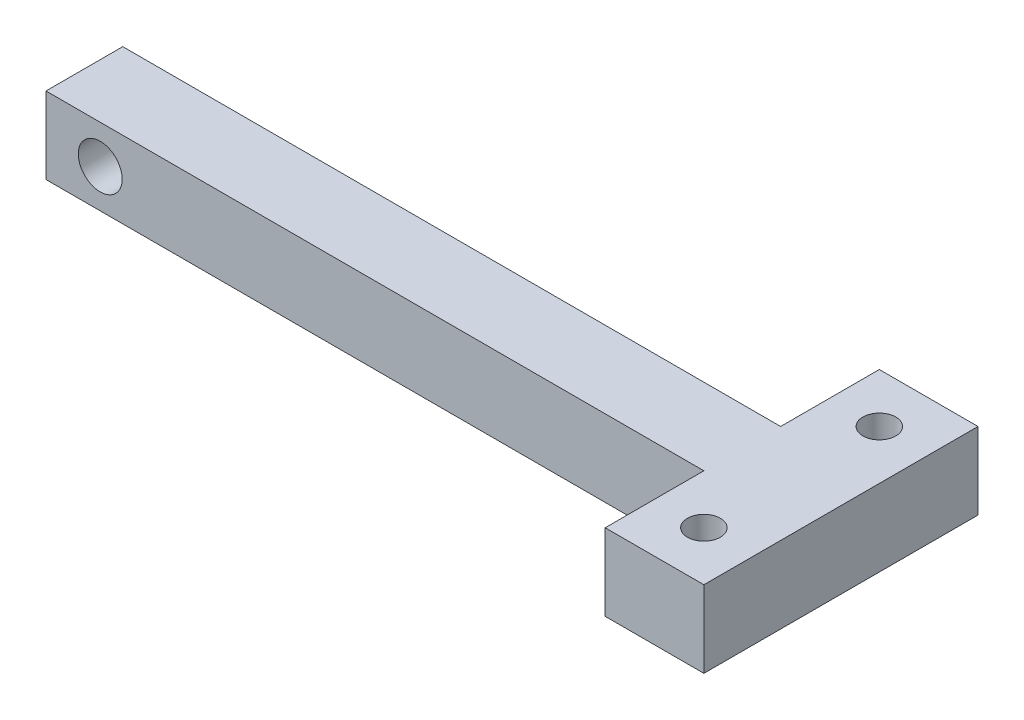
ISO-10303-21;
HEADER;
FILE_DESCRIPTION(('STEP AP214'),'2;1');
FILE_NAME('part.step','',(''),(''),'','','');
FILE_SCHEMA(('AUTOMOTIVE_DESIGN { 1 0 10303 214 1 1 1 1 }'));
ENDSEC;
DATA;
#1=APPLICATION_CONTEXT('core data for automotive mechanical design processes');
#2=APPLICATION_PROTOCOL_DEFINITION('international standard','automotive_design',2000,#1);
#3=PRODUCT_CONTEXT('',#1,'mechanical');
#4=PRODUCT('Part','Part','',(#3));
#5=PRODUCT_RELATED_PRODUCT_CATEGORY('part','',(#4));
#6=PRODUCT_DEFINITION_FORMATION('','',#4);
#7=PRODUCT_DEFINITION_CONTEXT('part definition',#1,'design');
#8=PRODUCT_DEFINITION('design','',#6,#7);
#9=PRODUCT_DEFINITION_SHAPE('','',#8);
#10=(LENGTH_UNIT() NAMED_UNIT(*) SI_UNIT(.MILLI.,.METRE.));
#11=(NAMED_UNIT(*) PLANE_ANGLE_UNIT() SI_UNIT($,.RADIAN.));
#12=(NAMED_UNIT(*) SI_UNIT($,.STERADIAN.) SOLID_ANGLE_UNIT());
#13=UNCERTAINTY_MEASURE_WITH_UNIT(LENGTH_MEASURE(1.E-05),#10,'distance_accuracy_value','');
#14=(GEOMETRIC_REPRESENTATION_CONTEXT(3) GLOBAL_UNCERTAINTY_ASSIGNED_CONTEXT((#13)) GLOBAL_UNIT_ASSIGNED_CONTEXT((#10,
#11,#12)) REPRESENTATION_CONTEXT('',''));
#15=CARTESIAN_POINT('',(0.,0.,0.));
#16=DIRECTION('',(0.,0.,1.));
#17=DIRECTION('',(1.,0.,0.));
#18=AXIS2_PLACEMENT_3D('',#15,#16,#17);
#19=CARTESIAN_POINT('',(69.,7.,0.));
#20=DIRECTION('',(1.,0.,0.));
#21=DIRECTION('',(0.,0.,-1.));
#22=AXIS2_PLACEMENT_3D('',#19,#20,#21);
#23=PLANE('',#22);
#24=DIRECTION('',(0.,0.,1.));
#25=VECTOR('',#24,1.);
#26=CARTESIAN_POINT('',(69.,0.,0.));
#27=LINE('',#26,#25);
#28=CARTESIAN_POINT('',(69.,0.,-16.));
#29=VERTEX_POINT('',#28);
#30=CARTESIAN_POINT('',(69.,0.,9.));
#31=VERTEX_POINT('',#30);
#32=EDGE_CURVE('E180',#29,#31,#27,.T.);
#33=ORIENTED_EDGE('',*,*,#32,.F.);
#34=DIRECTION('',(0.,-1.,0.));
#35=VECTOR('',#34,1.);
#36=CARTESIAN_POINT('',(69.,7.,-16.));
#37=LINE('',#36,#35);
#38=CARTESIAN_POINT('',(69.,7.,-16.));
#39=VERTEX_POINT('',#38);
#40=EDGE_CURVE('E11',#39,#29,#37,.T.);
#41=ORIENTED_EDGE('',*,*,#40,.F.);
#42=DIRECTION('',(0.,0.,1.));
#43=VECTOR('',#42,1.);
#44=CARTESIAN_POINT('',(69.,7.,0.));
#45=LINE('',#44,#43);
#46=CARTESIAN_POINT('',(69.,7.,9.));
#47=VERTEX_POINT('',#46);
#48=EDGE_CURVE('E270',#39,#47,#45,.T.);
#49=ORIENTED_EDGE('',*,*,#48,.T.);
#50=DIRECTION('',(0.,-1.,0.));
#51=VECTOR('',#50,1.);
#52=CARTESIAN_POINT('',(69.,7.,9.));
#53=LINE('',#52,#51);
#54=EDGE_CURVE('E99',#47,#31,#53,.T.);
#55=ORIENTED_EDGE('',*,*,#54,.T.);
#56=EDGE_LOOP('',(#33,#41,#49,#55));
#57=FACE_BOUND('',#56,.T.);
#58=ADVANCED_FACE('F47',(#57),#23,.T.);
#59=CARTESIAN_POINT('',(0.,7.,-16.));
#60=DIRECTION('',(0.,0.,-1.));
#61=DIRECTION('',(-1.,0.,0.));
#62=AXIS2_PLACEMENT_3D('',#59,#60,#61);
#63=PLANE('',#62);
#64=DIRECTION('',(1.,0.,0.));
#65=VECTOR('',#64,1.);
#66=CARTESIAN_POINT('',(0.,0.,-16.));
#67=LINE('',#66,#65);
#68=CARTESIAN_POINT('',(60.,0.,-16.));
#69=VERTEX_POINT('',#68);
#70=EDGE_CURVE('E171',#69,#29,#67,.T.);
#71=ORIENTED_EDGE('',*,*,#70,.F.);
#72=DIRECTION('',(0.,-1.,0.));
#73=VECTOR('',#72,1.);
#74=CARTESIAN_POINT('',(60.,7.,-16.));
#75=LINE('',#74,#73);
#76=CARTESIAN_POINT('',(60.,7.,-16.));
#77=VERTEX_POINT('',#76);
#78=EDGE_CURVE('E57',#77,#69,#75,.T.);
#79=ORIENTED_EDGE('',*,*,#78,.F.);
#80=DIRECTION('',(1.,0.,0.));
#81=VECTOR('',#80,1.);
#82=CARTESIAN_POINT('',(0.,7.,-16.));
#83=LINE('',#82,#81);
#84=EDGE_CURVE('E273',#77,#39,#83,.T.);
#85=ORIENTED_EDGE('',*,*,#84,.T.);
#86=ORIENTED_EDGE('',*,*,#40,.T.);
#87=EDGE_LOOP('',(#71,#79,#85,#86));
#88=FACE_BOUND('',#87,.T.);
#89=ADVANCED_FACE('F178',(#88),#63,.T.);
#90=CARTESIAN_POINT('',(60.,7.,0.));
#91=DIRECTION('',(1.,0.,0.));
#92=DIRECTION('',(0.,0.,-1.));
#93=AXIS2_PLACEMENT_3D('',#90,#91,#92);
#94=PLANE('',#93);
#95=DIRECTION('',(0.,0.,1.));
#96=VECTOR('',#95,1.);
#97=CARTESIAN_POINT('',(60.,0.,0.));
#98=LINE('',#97,#96);
#99=CARTESIAN_POINT('',(60.,0.,-7.));
#100=VERTEX_POINT('',#99);
#101=EDGE_CURVE('E163',#69,#100,#98,.T.);
#102=ORIENTED_EDGE('',*,*,#101,.T.);
#103=DIRECTION('',(0.,-1.,0.));
#104=VECTOR('',#103,1.);
#105=CARTESIAN_POINT('',(60.,7.,-7.));
#106=LINE('',#105,#104);
#107=CARTESIAN_POINT('',(60.,7.,-7.));
#108=VERTEX_POINT('',#107);
#109=EDGE_CURVE('E154',#108,#100,#106,.T.);
#110=ORIENTED_EDGE('',*,*,#109,.F.);
#111=DIRECTION('',(0.,0.,1.));
#112=VECTOR('',#111,1.);
#113=CARTESIAN_POINT('',(60.,7.,0.));
#114=LINE('',#113,#112);
#115=EDGE_CURVE('E129',#77,#108,#114,.T.);
#116=ORIENTED_EDGE('',*,*,#115,.F.);
#117=ORIENTED_EDGE('',*,*,#78,.T.);
#118=EDGE_LOOP('',(#102,#110,#116,#117));
#119=FACE_BOUND('',#118,.T.);
#120=ADVANCED_FACE('F161',(#119),#94,.F.);
#121=CARTESIAN_POINT('',(0.,7.,-7.));
#122=DIRECTION('',(0.,0.,-1.));
#123=DIRECTION('',(-1.,0.,0.));
#124=AXIS2_PLACEMENT_3D('',#121,#122,#123);
#125=PLANE('',#124);
#126=CARTESIAN_POINT('',(4.94497250678982,3.5,-7.));
#127=DIRECTION('',(0.,0.,-1.));
#128=DIRECTION('',(-1.,0.,0.));
#129=AXIS2_PLACEMENT_3D('',#126,#127,#128);
#130=CIRCLE('',#129,2.);
#131=CARTESIAN_POINT('',(2.94497250678982,3.5,-7.));
#132=VERTEX_POINT('',#131);
#133=EDGE_CURVE('E258',#132,#132,#130,.T.);
#134=ORIENTED_EDGE('',*,*,#133,.F.);
#135=EDGE_LOOP('',(#134));
#136=FACE_BOUND('',#135,.T.);
#137=DIRECTION('',(1.,0.,0.));
#138=VECTOR('',#137,1.);
#139=CARTESIAN_POINT('',(0.,0.,-7.));
#140=LINE('',#139,#138);
#141=CARTESIAN_POINT('',(0.,0.,-7.));
#142=VERTEX_POINT('',#141);
#143=EDGE_CURVE('E174',#142,#100,#140,.T.);
#144=ORIENTED_EDGE('',*,*,#143,.F.);
#145=DIRECTION('',(0.,-1.,0.));
#146=VECTOR('',#145,1.);
#147=CARTESIAN_POINT('',(0.,7.,-7.));
#148=LINE('',#147,#146);
#149=CARTESIAN_POINT('',(0.,7.,-7.));
#150=VERTEX_POINT('',#149);
#151=EDGE_CURVE('E147',#150,#142,#148,.T.);
#152=ORIENTED_EDGE('',*,*,#151,.F.);
#153=DIRECTION('',(1.,0.,0.));
#154=VECTOR('',#153,1.);
#155=CARTESIAN_POINT('',(0.,7.,-7.));
#156=LINE('',#155,#154);
#157=EDGE_CURVE('E277',#150,#108,#156,.T.);
#158=ORIENTED_EDGE('',*,*,#157,.T.);
#159=ORIENTED_EDGE('',*,*,#109,.T.);
#160=EDGE_LOOP('',(#144,#152,#158,#159));
#161=FACE_BOUND('',#160,.T.);
#162=ADVANCED_FACE('F228',(#136,#161),#125,.T.);
#163=CARTESIAN_POINT('',(0.,7.,0.));
#164=DIRECTION('',(-1.,0.,0.));
#165=DIRECTION('',(0.,0.,1.));
#166=AXIS2_PLACEMENT_3D('',#163,#164,#165);
#167=PLANE('',#166);
#168=DIRECTION('',(0.,0.,-1.));
#169=VECTOR('',#168,1.);
#170=CARTESIAN_POINT('',(0.,0.,0.));
#171=LINE('',#170,#169);
#172=CARTESIAN_POINT('',(0.,0.,0.));
#173=VERTEX_POINT('',#172);
#174=EDGE_CURVE('E189',#173,#142,#171,.T.);
#175=ORIENTED_EDGE('',*,*,#174,.F.);
#176=DIRECTION('',(0.,-1.,0.));
#177=VECTOR('',#176,1.);
#178=CARTESIAN_POINT('',(0.,7.,0.));
#179=LINE('',#178,#177);
#180=CARTESIAN_POINT('',(0.,7.,0.));
#181=VERTEX_POINT('',#180);
#182=EDGE_CURVE('E143',#181,#173,#179,.T.);
#183=ORIENTED_EDGE('',*,*,#182,.F.);
#184=DIRECTION('',(0.,0.,-1.));
#185=VECTOR('',#184,1.);
#186=CARTESIAN_POINT('',(0.,7.,0.));
#187=LINE('',#186,#185);
#188=EDGE_CURVE('E135',#181,#150,#187,.T.);
#189=ORIENTED_EDGE('',*,*,#188,.T.);
#190=ORIENTED_EDGE('',*,*,#151,.T.);
#191=EDGE_LOOP('',(#175,#183,#189,#190));
#192=FACE_BOUND('',#191,.T.);
#193=ADVANCED_FACE('F231',(#192),#167,.T.);
#194=CARTESIAN_POINT('',(0.,7.,0.));
#195=DIRECTION('',(0.,0.,-1.));
#196=DIRECTION('',(-1.,0.,0.));
#197=AXIS2_PLACEMENT_3D('',#194,#195,#196);
#198=PLANE('',#197);
#199=CARTESIAN_POINT('',(4.94497250678982,3.5,0.));
#200=DIRECTION('',(0.,0.,-1.));
#201=DIRECTION('',(-1.,0.,0.));
#202=AXIS2_PLACEMENT_3D('',#199,#200,#201);
#203=CIRCLE('',#202,2.);
#204=CARTESIAN_POINT('',(2.94497250678982,3.5,0.));
#205=VERTEX_POINT('',#204);
#206=EDGE_CURVE('E204',#205,#205,#203,.T.);
#207=ORIENTED_EDGE('',*,*,#206,.T.);
#208=EDGE_LOOP('',(#207));
#209=FACE_BOUND('',#208,.T.);
#210=DIRECTION('',(1.,0.,0.));
#211=VECTOR('',#210,1.);
#212=CARTESIAN_POINT('',(0.,0.,0.));
#213=LINE('',#212,#211);
#214=CARTESIAN_POINT('',(60.,0.,0.));
#215=VERTEX_POINT('',#214);
#216=EDGE_CURVE('E141',#173,#215,#213,.T.);
#217=ORIENTED_EDGE('',*,*,#216,.T.);
#218=DIRECTION('',(0.,-1.,0.));
#219=VECTOR('',#218,1.);
#220=CARTESIAN_POINT('',(60.,7.,0.));
#221=LINE('',#220,#219);
#222=CARTESIAN_POINT('',(60.,7.,0.));
#223=VERTEX_POINT('',#222);
#224=EDGE_CURVE('E123',#223,#215,#221,.T.);
#225=ORIENTED_EDGE('',*,*,#224,.F.);
#226=DIRECTION('',(1.,0.,0.));
#227=VECTOR('',#226,1.);
#228=CARTESIAN_POINT('',(0.,7.,0.));
#229=LINE('',#228,#227);
#230=EDGE_CURVE('E127',#181,#223,#229,.T.);
#231=ORIENTED_EDGE('',*,*,#230,.F.);
#232=ORIENTED_EDGE('',*,*,#182,.T.);
#233=EDGE_LOOP('',(#217,#225,#231,#232));
#234=FACE_BOUND('',#233,.T.);
#235=ADVANCED_FACE('F139',(#209,#234),#198,.F.);
#236=CARTESIAN_POINT('',(60.,0.,9.));
#237=VERTEX_POINT('',#236);
#238=EDGE_CURVE('E177',#215,#237,#98,.T.);
#239=ORIENTED_EDGE('',*,*,#238,.T.);
#240=DIRECTION('',(0.,-1.,0.));
#241=VECTOR('',#240,1.);
#242=CARTESIAN_POINT('',(60.,7.,9.));
#243=LINE('',#242,#241);
#244=CARTESIAN_POINT('',(60.,7.,9.));
#245=VERTEX_POINT('',#244);
#246=EDGE_CURVE('E125',#245,#237,#243,.T.);
#247=ORIENTED_EDGE('',*,*,#246,.F.);
#248=EDGE_CURVE('E118',#223,#245,#114,.T.);
#249=ORIENTED_EDGE('',*,*,#248,.F.);
#250=ORIENTED_EDGE('',*,*,#224,.T.);
#251=EDGE_LOOP('',(#239,#247,#249,#250));
#252=FACE_BOUND('',#251,.T.);
#253=ADVANCED_FACE('F121',(#252),#94,.F.);
#254=CARTESIAN_POINT('',(64.5,7.,-11.5));
#255=DIRECTION('',(0.,-1.,0.));
#256=DIRECTION('',(0.,0.,-1.));
#257=AXIS2_PLACEMENT_3D('',#254,#255,#256);
#258=CYLINDRICAL_SURFACE('',#257,1.5);
#259=CARTESIAN_POINT('',(64.5,7.,-11.5));
#260=DIRECTION('',(0.,1.,0.));
#261=DIRECTION('',(0.,0.,1.));
#262=AXIS2_PLACEMENT_3D('',#259,#260,#261);
#263=CIRCLE('',#262,1.5);
#264=CARTESIAN_POINT('',(64.5,7.,-10.));
#265=VERTEX_POINT('',#264);
#266=EDGE_CURVE('E267',#265,#265,#263,.T.);
#267=ORIENTED_EDGE('',*,*,#266,.T.);
#268=EDGE_LOOP('',(#267));
#269=FACE_BOUND('',#268,.T.);
#270=CARTESIAN_POINT('',(64.5,0.,-11.5));
#271=DIRECTION('',(0.,1.,0.));
#272=DIRECTION('',(0.,0.,1.));
#273=AXIS2_PLACEMENT_3D('',#270,#271,#272);
#274=CIRCLE('',#273,1.5);
#275=CARTESIAN_POINT('',(64.5,0.,-10.));
#276=VERTEX_POINT('',#275);
#277=EDGE_CURVE('E183',#276,#276,#274,.T.);
#278=ORIENTED_EDGE('',*,*,#277,.F.);
#279=EDGE_LOOP('',(#278));
#280=FACE_BOUND('',#279,.T.);
#281=ADVANCED_FACE('F210',(#269,#280),#258,.F.);
#282=CARTESIAN_POINT('',(64.5,7.,4.5));
#283=DIRECTION('',(0.,-1.,0.));
#284=DIRECTION('',(0.,0.,-1.));
#285=AXIS2_PLACEMENT_3D('',#282,#283,#284);
#286=CYLINDRICAL_SURFACE('',#285,1.5);
#287=CARTESIAN_POINT('',(64.5,7.,4.5));
#288=DIRECTION('',(0.,1.,0.));
#289=DIRECTION('',(0.,0.,1.));
#290=AXIS2_PLACEMENT_3D('',#287,#288,#289);
#291=CIRCLE('',#290,1.5);
#292=CARTESIAN_POINT('',(64.5,7.,6.));
#293=VERTEX_POINT('',#292);
#294=EDGE_CURVE('E195',#293,#293,#291,.T.);
#295=ORIENTED_EDGE('',*,*,#294,.T.);
#296=EDGE_LOOP('',(#295));
#297=FACE_BOUND('',#296,.T.);
#298=CARTESIAN_POINT('',(64.5,0.,4.5));
#299=DIRECTION('',(0.,1.,0.));
#300=DIRECTION('',(0.,0.,1.));
#301=AXIS2_PLACEMENT_3D('',#298,#299,#300);
#302=CIRCLE('',#301,1.5);
#303=CARTESIAN_POINT('',(64.5,0.,6.));
#304=VERTEX_POINT('',#303);
#305=EDGE_CURVE('E201',#304,#304,#302,.T.);
#306=ORIENTED_EDGE('',*,*,#305,.F.);
#307=EDGE_LOOP('',(#306));
#308=FACE_BOUND('',#307,.T.);
#309=ADVANCED_FACE('F49',(#297,#308),#286,.F.);
#310=CARTESIAN_POINT('',(0.,7.,9.00000000000001));
#311=DIRECTION('',(0.,0.,-1.));
#312=DIRECTION('',(-1.,0.,0.));
#313=AXIS2_PLACEMENT_3D('',#310,#311,#312);
#314=PLANE('',#313);
#315=DIRECTION('',(1.,0.,0.));
#316=VECTOR('',#315,1.);
#317=CARTESIAN_POINT('',(0.,0.,9.00000000000001));
#318=LINE('',#317,#316);
#319=EDGE_CURVE('E92',#237,#31,#318,.T.);
#320=ORIENTED_EDGE('',*,*,#319,.T.);
#321=ORIENTED_EDGE('',*,*,#54,.F.);
#322=DIRECTION('',(1.,0.,0.));
#323=VECTOR('',#322,1.);
#324=CARTESIAN_POINT('',(0.,7.,9.00000000000001));
#325=LINE('',#324,#323);
#326=EDGE_CURVE('E65',#245,#47,#325,.T.);
#327=ORIENTED_EDGE('',*,*,#326,.F.);
#328=ORIENTED_EDGE('',*,*,#246,.T.);
#329=EDGE_LOOP('',(#320,#321,#327,#328));
#330=FACE_BOUND('',#329,.T.);
#331=ADVANCED_FACE('F217',(#330),#314,.F.);
#332=CARTESIAN_POINT('',(0.,7.,0.));
#333=DIRECTION('',(0.,1.,0.));
#334=DIRECTION('',(0.,0.,1.));
#335=AXIS2_PLACEMENT_3D('',#332,#333,#334);
#336=PLANE('',#335);
#337=ORIENTED_EDGE('',*,*,#294,.F.);
#338=EDGE_LOOP('',(#337));
#339=FACE_BOUND('',#338,.T.);
#340=ORIENTED_EDGE('',*,*,#266,.F.);
#341=EDGE_LOOP('',(#340));
#342=FACE_BOUND('',#341,.T.);
#343=ORIENTED_EDGE('',*,*,#48,.F.);
#344=ORIENTED_EDGE('',*,*,#84,.F.);
#345=ORIENTED_EDGE('',*,*,#115,.T.);
#346=ORIENTED_EDGE('',*,*,#157,.F.);
#347=ORIENTED_EDGE('',*,*,#188,.F.);
#348=ORIENTED_EDGE('',*,*,#230,.T.);
#349=ORIENTED_EDGE('',*,*,#248,.T.);
#350=ORIENTED_EDGE('',*,*,#326,.T.);
#351=EDGE_LOOP('',(#343,#344,#345,#346,#347,#348,#349,#350));
#352=FACE_BOUND('',#351,.T.);
#353=ADVANCED_FACE('F132',(#339,#342,#352),#336,.T.);
#354=CARTESIAN_POINT('',(0.,0.,0.));
#355=DIRECTION('',(0.,1.,0.));
#356=DIRECTION('',(0.,0.,1.));
#357=AXIS2_PLACEMENT_3D('',#354,#355,#356);
#358=PLANE('',#357);
#359=ORIENTED_EDGE('',*,*,#305,.T.);
#360=EDGE_LOOP('',(#359));
#361=FACE_BOUND('',#360,.T.);
#362=ORIENTED_EDGE('',*,*,#277,.T.);
#363=EDGE_LOOP('',(#362));
#364=FACE_BOUND('',#363,.T.);
#365=ORIENTED_EDGE('',*,*,#32,.T.);
#366=ORIENTED_EDGE('',*,*,#319,.F.);
#367=ORIENTED_EDGE('',*,*,#238,.F.);
#368=ORIENTED_EDGE('',*,*,#216,.F.);
#369=ORIENTED_EDGE('',*,*,#174,.T.);
#370=ORIENTED_EDGE('',*,*,#143,.T.);
#371=ORIENTED_EDGE('',*,*,#101,.F.);
#372=ORIENTED_EDGE('',*,*,#70,.T.);
#373=EDGE_LOOP('',(#365,#366,#367,#368,#369,#370,#371,#372));
#374=FACE_BOUND('',#373,.T.);
#375=ADVANCED_FACE('F170',(#361,#364,#374),#358,.F.);
#376=CARTESIAN_POINT('',(4.94497250678982,3.5,0.));
#377=DIRECTION('',(0.,0.,-1.));
#378=DIRECTION('',(-1.,0.,0.));
#379=AXIS2_PLACEMENT_3D('',#376,#377,#378);
#380=CYLINDRICAL_SURFACE('',#379,2.);
#381=ORIENTED_EDGE('',*,*,#206,.F.);
#382=EDGE_LOOP('',(#381));
#383=FACE_BOUND('',#382,.T.);
#384=ORIENTED_EDGE('',*,*,#133,.T.);
#385=EDGE_LOOP('',(#384));
#386=FACE_BOUND('',#385,.T.);
#387=ADVANCED_FACE('F244',(#383,#386),#380,.F.);
#388=CLOSED_SHELL('',(#58,#89,#120,#162,#193,#235,#253,#281,#309,#331,#353,#375,#387));
#389=MANIFOLD_SOLID_BREP('B2',#388);
#390=ADVANCED_BREP_SHAPE_REPRESENTATION('',(#18,#389),#14);
#391=SHAPE_DEFINITION_REPRESENTATION(#9,#390);
ENDSEC;
END-ISO-10303-21;
